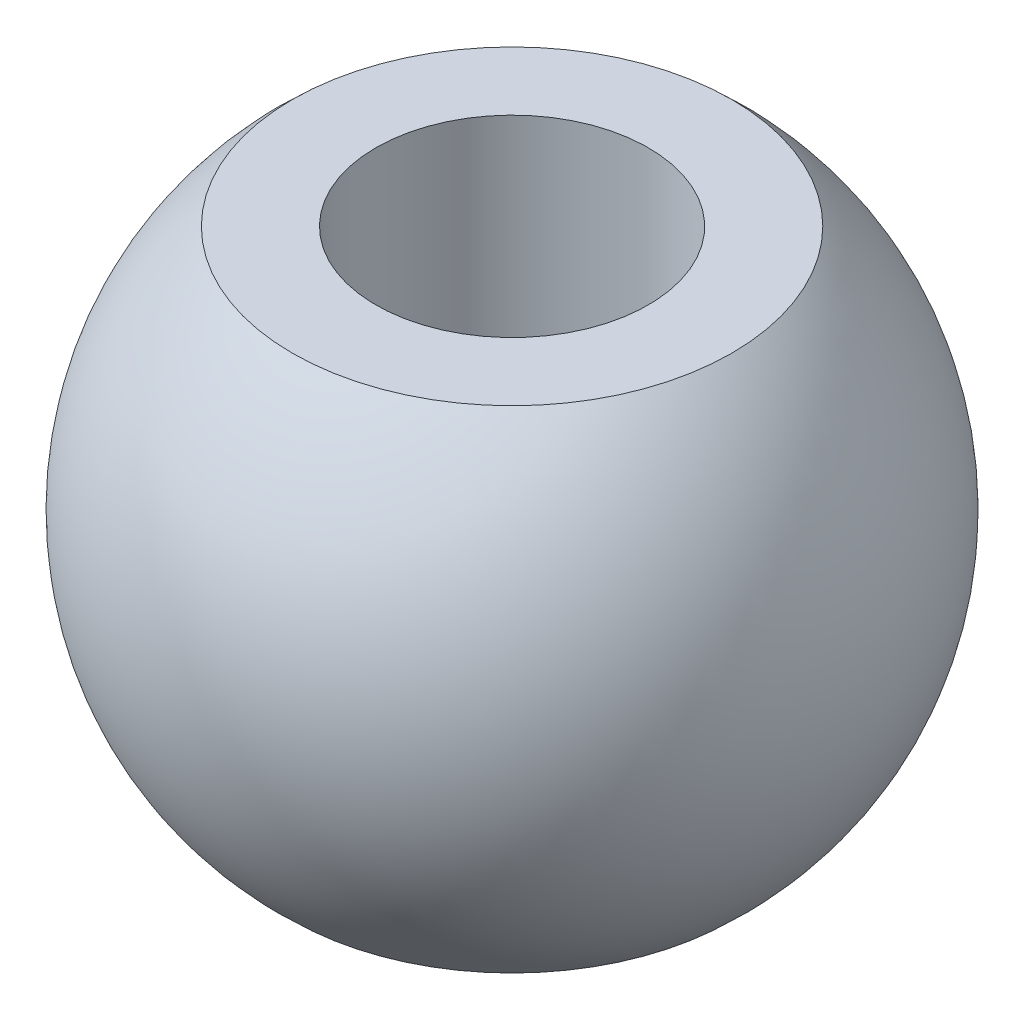
ISO-10303-21;
HEADER;
FILE_DESCRIPTION(('STEP AP214'),'2;1');
FILE_NAME('part.step','',(''),(''),'','','');
FILE_SCHEMA(('AUTOMOTIVE_DESIGN { 1 0 10303 214 1 1 1 1 }'));
ENDSEC;
DATA;
#1=APPLICATION_CONTEXT('core data for automotive mechanical design processes');
#2=APPLICATION_PROTOCOL_DEFINITION('international standard','automotive_design',2000,#1);
#3=PRODUCT_CONTEXT('',#1,'mechanical');
#4=PRODUCT('Part','Part','',(#3));
#5=PRODUCT_RELATED_PRODUCT_CATEGORY('part','',(#4));
#6=PRODUCT_DEFINITION_FORMATION('','',#4);
#7=PRODUCT_DEFINITION_CONTEXT('part definition',#1,'design');
#8=PRODUCT_DEFINITION('design','',#6,#7);
#9=PRODUCT_DEFINITION_SHAPE('','',#8);
#10=(LENGTH_UNIT() NAMED_UNIT(*) SI_UNIT(.MILLI.,.METRE.));
#11=(NAMED_UNIT(*) PLANE_ANGLE_UNIT() SI_UNIT($,.RADIAN.));
#12=(NAMED_UNIT(*) SI_UNIT($,.STERADIAN.) SOLID_ANGLE_UNIT());
#13=UNCERTAINTY_MEASURE_WITH_UNIT(LENGTH_MEASURE(1.E-05),#10,'distance_accuracy_value','');
#14=(GEOMETRIC_REPRESENTATION_CONTEXT(3) GLOBAL_UNCERTAINTY_ASSIGNED_CONTEXT((#13)) GLOBAL_UNIT_ASSIGNED_CONTEXT((#10,
#11,#12)) REPRESENTATION_CONTEXT('',''));
#15=CARTESIAN_POINT('',(0.,0.,0.));
#16=DIRECTION('',(0.,0.,1.));
#17=DIRECTION('',(1.,0.,0.));
#18=AXIS2_PLACEMENT_3D('',#15,#16,#17);
#19=CARTESIAN_POINT('',(0.,5.59016994374947,0.));
#20=DIRECTION('',(0.,1.,0.));
#21=DIRECTION('',(-1.,0.,0.));
#22=AXIS2_PLACEMENT_3D('',#19,#20,#21);
#23=PLANE('',#22);
#24=CARTESIAN_POINT('',(0.,5.59016994374947,0.));
#25=DIRECTION('',(0.,1.,0.));
#26=DIRECTION('',(-1.,0.,0.));
#27=AXIS2_PLACEMENT_3D('',#24,#25,#26);
#28=CIRCLE('',#27,3.1);
#29=CARTESIAN_POINT('',(-3.1,5.59016994374947,0.));
#30=VERTEX_POINT('',#29);
#31=EDGE_CURVE('E54',#30,#30,#28,.T.);
#32=ORIENTED_EDGE('',*,*,#31,.F.);
#33=EDGE_LOOP('',(#32));
#34=FACE_BOUND('',#33,.T.);
#35=CARTESIAN_POINT('',(0.,5.59016994374947,0.));
#36=DIRECTION('',(0.,1.,0.));
#37=DIRECTION('',(-1.,0.,0.));
#38=AXIS2_PLACEMENT_3D('',#35,#36,#37);
#39=CIRCLE('',#38,5.);
#40=CARTESIAN_POINT('',(-5.,5.59016994374947,0.));
#41=VERTEX_POINT('',#40);
#42=EDGE_CURVE('E10',#41,#41,#39,.T.);
#43=ORIENTED_EDGE('',*,*,#42,.T.);
#44=EDGE_LOOP('',(#43));
#45=FACE_BOUND('',#44,.T.);
#46=ADVANCED_FACE('F37',(#34,#45),#23,.T.);
#47=CARTESIAN_POINT('',(0.,0.,0.));
#48=DIRECTION('',(0.,1.,0.));
#49=DIRECTION('',(-1.,0.,0.));
#50=AXIS2_PLACEMENT_3D('',#47,#48,#49);
#51=SPHERICAL_SURFACE('',#50,7.5);
#52=CARTESIAN_POINT('',(0.,-5.59016994374947,0.));
#53=DIRECTION('',(0.,1.,0.));
#54=DIRECTION('',(-1.,0.,0.));
#55=AXIS2_PLACEMENT_3D('',#52,#53,#54);
#56=CIRCLE('',#55,5.);
#57=CARTESIAN_POINT('',(-5.,-5.59016994374947,0.));
#58=VERTEX_POINT('',#57);
#59=EDGE_CURVE('E44',#58,#58,#56,.T.);
#60=ORIENTED_EDGE('',*,*,#59,.T.);
#61=EDGE_LOOP('',(#60));
#62=FACE_BOUND('',#61,.T.);
#63=ORIENTED_EDGE('',*,*,#42,.F.);
#64=EDGE_LOOP('',(#63));
#65=FACE_BOUND('',#64,.T.);
#66=ADVANCED_FACE('F64',(#62,#65),#51,.T.);
#67=CARTESIAN_POINT('',(-5.,-5.59016994374947,0.));
#68=DIRECTION('',(0.,-1.,0.));
#69=DIRECTION('',(1.,0.,0.));
#70=AXIS2_PLACEMENT_3D('',#67,#68,#69);
#71=PLANE('',#70);
#72=CARTESIAN_POINT('',(0.,-5.59016994374947,0.));
#73=DIRECTION('',(0.,1.,0.));
#74=DIRECTION('',(-1.,0.,0.));
#75=AXIS2_PLACEMENT_3D('',#72,#73,#74);
#76=CIRCLE('',#75,3.1);
#77=CARTESIAN_POINT('',(-3.1,-5.59016994374947,0.));
#78=VERTEX_POINT('',#77);
#79=EDGE_CURVE('E49',#78,#78,#76,.T.);
#80=ORIENTED_EDGE('',*,*,#79,.T.);
#81=EDGE_LOOP('',(#80));
#82=FACE_BOUND('',#81,.T.);
#83=ORIENTED_EDGE('',*,*,#59,.F.);
#84=EDGE_LOOP('',(#83));
#85=FACE_BOUND('',#84,.T.);
#86=ADVANCED_FACE('F68',(#82,#85),#71,.T.);
#87=CARTESIAN_POINT('',(0.,-5.59016994374947,0.));
#88=DIRECTION('',(0.,1.,0.));
#89=DIRECTION('',(-1.,0.,0.));
#90=AXIS2_PLACEMENT_3D('',#87,#88,#89);
#91=CYLINDRICAL_SURFACE('',#90,3.1);
#92=ORIENTED_EDGE('',*,*,#79,.F.);
#93=EDGE_LOOP('',(#92));
#94=FACE_BOUND('',#93,.T.);
#95=ORIENTED_EDGE('',*,*,#31,.T.);
#96=EDGE_LOOP('',(#95));
#97=FACE_BOUND('',#96,.T.);
#98=ADVANCED_FACE('F61',(#94,#97),#91,.F.);
#99=CLOSED_SHELL('',(#46,#66,#86,#98));
#100=MANIFOLD_SOLID_BREP('B2',#99);
#101=ADVANCED_BREP_SHAPE_REPRESENTATION('',(#18,#100),#14);
#102=SHAPE_DEFINITION_REPRESENTATION(#9,#101);
ENDSEC;
END-ISO-10303-21;
